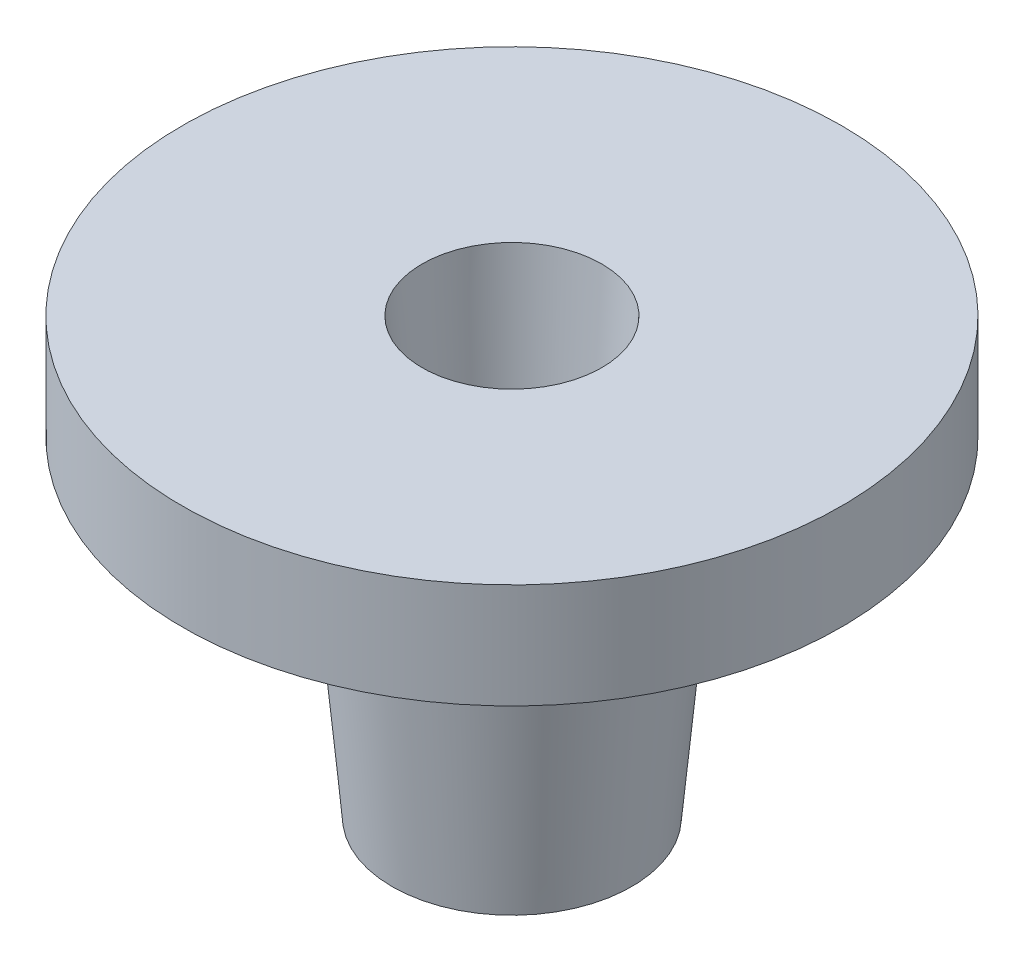
ISO-10303-21;
HEADER;
FILE_DESCRIPTION(('STEP AP214'),'2;1');
FILE_NAME('part.step','',(''),(''),'','','');
FILE_SCHEMA(('AUTOMOTIVE_DESIGN { 1 0 10303 214 1 1 1 1 }'));
ENDSEC;
DATA;
#1=APPLICATION_CONTEXT('core data for automotive mechanical design processes');
#2=APPLICATION_PROTOCOL_DEFINITION('international standard','automotive_design',2000,#1);
#3=PRODUCT_CONTEXT('',#1,'mechanical');
#4=PRODUCT('Part','Part','',(#3));
#5=PRODUCT_RELATED_PRODUCT_CATEGORY('part','',(#4));
#6=PRODUCT_DEFINITION_FORMATION('','',#4);
#7=PRODUCT_DEFINITION_CONTEXT('part definition',#1,'design');
#8=PRODUCT_DEFINITION('design','',#6,#7);
#9=PRODUCT_DEFINITION_SHAPE('','',#8);
#10=(LENGTH_UNIT() NAMED_UNIT(*) SI_UNIT(.MILLI.,.METRE.));
#11=(NAMED_UNIT(*) PLANE_ANGLE_UNIT() SI_UNIT($,.RADIAN.));
#12=(NAMED_UNIT(*) SI_UNIT($,.STERADIAN.) SOLID_ANGLE_UNIT());
#13=UNCERTAINTY_MEASURE_WITH_UNIT(LENGTH_MEASURE(1.E-05),#10,'distance_accuracy_value','');
#14=(GEOMETRIC_REPRESENTATION_CONTEXT(3) GLOBAL_UNCERTAINTY_ASSIGNED_CONTEXT((#13)) GLOBAL_UNIT_ASSIGNED_CONTEXT((#10,
#11,#12)) REPRESENTATION_CONTEXT('',''));
#15=CARTESIAN_POINT('',(0.,0.,0.));
#16=DIRECTION('',(0.,0.,1.));
#17=DIRECTION('',(1.,0.,0.));
#18=AXIS2_PLACEMENT_3D('',#15,#16,#17);
#19=CARTESIAN_POINT('',(0.,0.,0.));
#20=DIRECTION('',(0.,1.,0.));
#21=DIRECTION('',(0.,0.,1.));
#22=AXIS2_PLACEMENT_3D('',#19,#20,#21);
#23=PLANE('',#22);
#24=CARTESIAN_POINT('',(7.,0.,0.));
#25=DIRECTION('',(0.,-1.,0.));
#26=DIRECTION('',(0.,0.,-1.));
#27=AXIS2_PLACEMENT_3D('',#24,#25,#26);
#28=CIRCLE('',#27,2.);
#29=CARTESIAN_POINT('',(7.,0.,-2.));
#30=VERTEX_POINT('',#29);
#31=EDGE_CURVE('E10',#30,#30,#28,.T.);
#32=ORIENTED_EDGE('',*,*,#31,.F.);
#33=EDGE_LOOP('',(#32));
#34=FACE_BOUND('',#33,.T.);
#35=CARTESIAN_POINT('',(7.,0.,0.));
#36=DIRECTION('',(0.,-1.,0.));
#37=DIRECTION('',(0.,0.,-1.));
#38=AXIS2_PLACEMENT_3D('',#35,#36,#37);
#39=CIRCLE('',#38,4.);
#40=CARTESIAN_POINT('',(7.,0.,-4.));
#41=VERTEX_POINT('',#40);
#42=EDGE_CURVE('E59',#41,#41,#39,.T.);
#43=ORIENTED_EDGE('',*,*,#42,.T.);
#44=EDGE_LOOP('',(#43));
#45=FACE_BOUND('',#44,.T.);
#46=ADVANCED_FACE('F37',(#34,#45),#23,.F.);
#47=CARTESIAN_POINT('',(7.,0.,0.));
#48=DIRECTION('',(0.,1.,0.));
#49=DIRECTION('',(0.,0.,1.));
#50=AXIS2_PLACEMENT_3D('',#47,#48,#49);
#51=CONICAL_SURFACE('',#50,2.,0.0688564893010447);
#52=CARTESIAN_POINT('',(7.,14.5,0.));
#53=DIRECTION('',(0.,-1.,0.));
#54=DIRECTION('',(0.,0.,-1.));
#55=AXIS2_PLACEMENT_3D('',#52,#53,#54);
#56=CIRCLE('',#55,3.);
#57=CARTESIAN_POINT('',(7.,14.5,-3.));
#58=VERTEX_POINT('',#57);
#59=EDGE_CURVE('E43',#58,#58,#56,.T.);
#60=ORIENTED_EDGE('',*,*,#59,.F.);
#61=EDGE_LOOP('',(#60));
#62=FACE_BOUND('',#61,.T.);
#63=ORIENTED_EDGE('',*,*,#31,.T.);
#64=EDGE_LOOP('',(#63));
#65=FACE_BOUND('',#64,.T.);
#66=ADVANCED_FACE('F82',(#62,#65),#51,.F.);
#67=CARTESIAN_POINT('',(0.,14.5,0.));
#68=DIRECTION('',(0.,1.,0.));
#69=DIRECTION('',(0.,0.,1.));
#70=AXIS2_PLACEMENT_3D('',#67,#68,#69);
#71=PLANE('',#70);
#72=ORIENTED_EDGE('',*,*,#59,.T.);
#73=EDGE_LOOP('',(#72));
#74=FACE_BOUND('',#73,.T.);
#75=CARTESIAN_POINT('',(7.,14.5,0.));
#76=DIRECTION('',(0.,-1.,0.));
#77=DIRECTION('',(0.,0.,-1.));
#78=AXIS2_PLACEMENT_3D('',#75,#76,#77);
#79=CIRCLE('',#78,11.);
#80=CARTESIAN_POINT('',(7.,14.5,-11.));
#81=VERTEX_POINT('',#80);
#82=EDGE_CURVE('E47',#81,#81,#79,.T.);
#83=ORIENTED_EDGE('',*,*,#82,.F.);
#84=EDGE_LOOP('',(#83));
#85=FACE_BOUND('',#84,.T.);
#86=ADVANCED_FACE('F78',(#74,#85),#71,.T.);
#87=CARTESIAN_POINT('',(7.,0.,0.));
#88=DIRECTION('',(0.,-1.,0.));
#89=DIRECTION('',(0.,0.,-1.));
#90=AXIS2_PLACEMENT_3D('',#87,#88,#89);
#91=CYLINDRICAL_SURFACE('',#90,11.);
#92=ORIENTED_EDGE('',*,*,#82,.T.);
#93=EDGE_LOOP('',(#92));
#94=FACE_BOUND('',#93,.T.);
#95=CARTESIAN_POINT('',(7.,11.,0.));
#96=DIRECTION('',(0.,-1.,0.));
#97=DIRECTION('',(0.,0.,-1.));
#98=AXIS2_PLACEMENT_3D('',#95,#96,#97);
#99=CIRCLE('',#98,11.);
#100=CARTESIAN_POINT('',(7.,11.,-11.));
#101=VERTEX_POINT('',#100);
#102=EDGE_CURVE('E51',#101,#101,#99,.T.);
#103=ORIENTED_EDGE('',*,*,#102,.F.);
#104=EDGE_LOOP('',(#103));
#105=FACE_BOUND('',#104,.T.);
#106=ADVANCED_FACE('F72',(#94,#105),#91,.T.);
#107=CARTESIAN_POINT('',(0.,11.,0.));
#108=DIRECTION('',(0.,-1.,0.));
#109=DIRECTION('',(0.,0.,-1.));
#110=AXIS2_PLACEMENT_3D('',#107,#108,#109);
#111=PLANE('',#110);
#112=ORIENTED_EDGE('',*,*,#102,.T.);
#113=EDGE_LOOP('',(#112));
#114=FACE_BOUND('',#113,.T.);
#115=CARTESIAN_POINT('',(7.,11.,0.));
#116=DIRECTION('',(0.,-1.,0.));
#117=DIRECTION('',(0.,0.,-1.));
#118=AXIS2_PLACEMENT_3D('',#115,#116,#117);
#119=CIRCLE('',#118,5.);
#120=CARTESIAN_POINT('',(7.,11.,-5.));
#121=VERTEX_POINT('',#120);
#122=EDGE_CURVE('E56',#121,#121,#119,.T.);
#123=ORIENTED_EDGE('',*,*,#122,.F.);
#124=EDGE_LOOP('',(#123));
#125=FACE_BOUND('',#124,.T.);
#126=ADVANCED_FACE('F67',(#114,#125),#111,.T.);
#127=CARTESIAN_POINT('',(7.,11.,0.));
#128=DIRECTION('',(0.,1.,0.));
#129=DIRECTION('',(0.,0.,1.));
#130=AXIS2_PLACEMENT_3D('',#127,#128,#129);
#131=CONICAL_SURFACE('',#130,5.,0.0906598872007451);
#132=ORIENTED_EDGE('',*,*,#42,.F.);
#133=EDGE_LOOP('',(#132));
#134=FACE_BOUND('',#133,.T.);
#135=ORIENTED_EDGE('',*,*,#122,.T.);
#136=EDGE_LOOP('',(#135));
#137=FACE_BOUND('',#136,.T.);
#138=ADVANCED_FACE('F64',(#134,#137),#131,.T.);
#139=CLOSED_SHELL('',(#46,#66,#86,#106,#126,#138));
#140=MANIFOLD_SOLID_BREP('B2',#139);
#141=ADVANCED_BREP_SHAPE_REPRESENTATION('',(#18,#140),#14);
#142=SHAPE_DEFINITION_REPRESENTATION(#9,#141);
ENDSEC;
END-ISO-10303-21;
